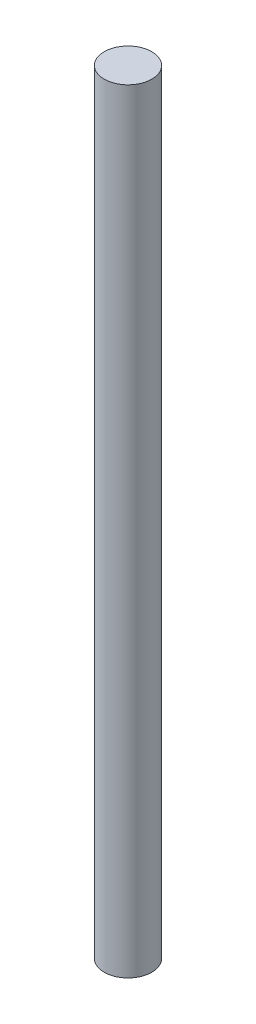
ISO-10303-21;
HEADER;
FILE_DESCRIPTION(('STEP AP214'),'2;1');
FILE_NAME('part.step','',(''),(''),'','','');
FILE_SCHEMA(('AUTOMOTIVE_DESIGN { 1 0 10303 214 1 1 1 1 }'));
ENDSEC;
DATA;
#1=APPLICATION_CONTEXT('core data for automotive mechanical design processes');
#2=APPLICATION_PROTOCOL_DEFINITION('international standard','automotive_design',2000,#1);
#3=PRODUCT_CONTEXT('',#1,'mechanical');
#4=PRODUCT('Part','Part','',(#3));
#5=PRODUCT_RELATED_PRODUCT_CATEGORY('part','',(#4));
#6=PRODUCT_DEFINITION_FORMATION('','',#4);
#7=PRODUCT_DEFINITION_CONTEXT('part definition',#1,'design');
#8=PRODUCT_DEFINITION('design','',#6,#7);
#9=PRODUCT_DEFINITION_SHAPE('','',#8);
#10=(LENGTH_UNIT() NAMED_UNIT(*) SI_UNIT(.MILLI.,.METRE.));
#11=(NAMED_UNIT(*) PLANE_ANGLE_UNIT() SI_UNIT($,.RADIAN.));
#12=(NAMED_UNIT(*) SI_UNIT($,.STERADIAN.) SOLID_ANGLE_UNIT());
#13=UNCERTAINTY_MEASURE_WITH_UNIT(LENGTH_MEASURE(1.E-05),#10,'distance_accuracy_value','');
#14=(GEOMETRIC_REPRESENTATION_CONTEXT(3) GLOBAL_UNCERTAINTY_ASSIGNED_CONTEXT((#13)) GLOBAL_UNIT_ASSIGNED_CONTEXT((#10,
#11,#12)) REPRESENTATION_CONTEXT('',''));
#15=CARTESIAN_POINT('',(0.,0.,0.));
#16=DIRECTION('',(0.,0.,1.));
#17=DIRECTION('',(1.,0.,0.));
#18=AXIS2_PLACEMENT_3D('',#15,#16,#17);
#19=CARTESIAN_POINT('',(0.,32.5,0.));
#20=DIRECTION('',(0.,1.,0.));
#21=DIRECTION('',(0.,0.,1.));
#22=AXIS2_PLACEMENT_3D('',#19,#20,#21);
#23=PLANE('',#22);
#24=CARTESIAN_POINT('',(0.,32.5,0.));
#25=DIRECTION('',(0.,-1.,0.));
#26=DIRECTION('',(0.,0.,-1.));
#27=AXIS2_PLACEMENT_3D('',#24,#25,#26);
#28=CIRCLE('',#27,2.);
#29=CARTESIAN_POINT('',(0.,32.5,-2.));
#30=VERTEX_POINT('',#29);
#31=EDGE_CURVE('E10',#30,#30,#28,.T.);
#32=ORIENTED_EDGE('',*,*,#31,.F.);
#33=EDGE_LOOP('',(#32));
#34=FACE_BOUND('',#33,.T.);
#35=ADVANCED_FACE('F30',(#34),#23,.T.);
#36=CARTESIAN_POINT('',(0.,0.,0.));
#37=DIRECTION('',(0.,-1.,0.));
#38=DIRECTION('',(0.,0.,-1.));
#39=AXIS2_PLACEMENT_3D('',#36,#37,#38);
#40=CYLINDRICAL_SURFACE('',#39,2.);
#41=ORIENTED_EDGE('',*,*,#31,.T.);
#42=EDGE_LOOP('',(#41));
#43=FACE_BOUND('',#42,.T.);
#44=CARTESIAN_POINT('',(0.,-32.5,0.));
#45=DIRECTION('',(0.,-1.,0.));
#46=DIRECTION('',(0.,0.,-1.));
#47=AXIS2_PLACEMENT_3D('',#44,#45,#46);
#48=CIRCLE('',#47,2.);
#49=CARTESIAN_POINT('',(0.,-32.5,-2.));
#50=VERTEX_POINT('',#49);
#51=EDGE_CURVE('E36',#50,#50,#48,.T.);
#52=ORIENTED_EDGE('',*,*,#51,.F.);
#53=EDGE_LOOP('',(#52));
#54=FACE_BOUND('',#53,.T.);
#55=ADVANCED_FACE('F44',(#43,#54),#40,.T.);
#56=CARTESIAN_POINT('',(0.,-32.5,0.));
#57=DIRECTION('',(0.,-1.,0.));
#58=DIRECTION('',(0.,0.,-1.));
#59=AXIS2_PLACEMENT_3D('',#56,#57,#58);
#60=PLANE('',#59);
#61=ORIENTED_EDGE('',*,*,#51,.T.);
#62=EDGE_LOOP('',(#61));
#63=FACE_BOUND('',#62,.T.);
#64=ADVANCED_FACE('F42',(#63),#60,.T.);
#65=CLOSED_SHELL('',(#35,#55,#64));
#66=MANIFOLD_SOLID_BREP('B2',#65);
#67=ADVANCED_BREP_SHAPE_REPRESENTATION('',(#18,#66),#14);
#68=SHAPE_DEFINITION_REPRESENTATION(#9,#67);
ENDSEC;
END-ISO-10303-21;
